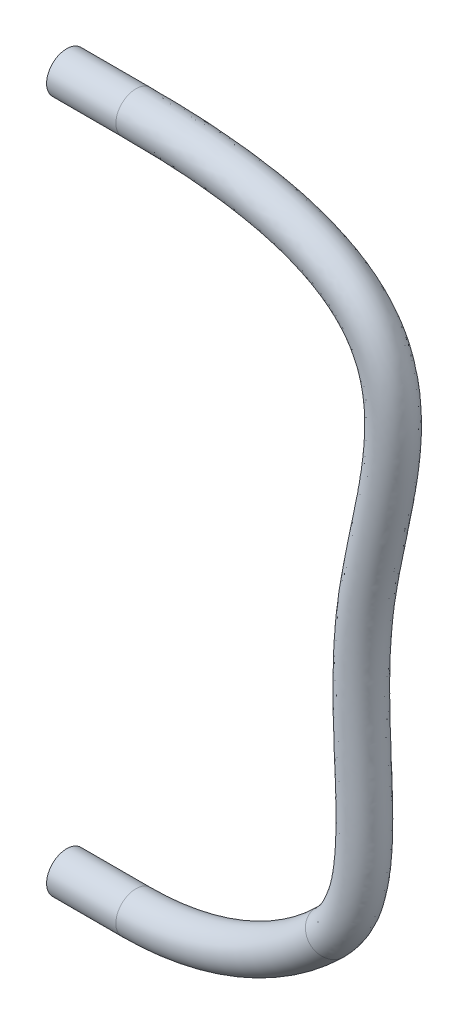
ISO-10303-21;
HEADER;
FILE_DESCRIPTION(('STEP AP214'),'2;1');
FILE_NAME('part.step','',(''),(''),'','','');
FILE_SCHEMA(('AUTOMOTIVE_DESIGN { 1 0 10303 214 1 1 1 1 }'));
ENDSEC;
DATA;
#1=APPLICATION_CONTEXT('core data for automotive mechanical design processes');
#2=APPLICATION_PROTOCOL_DEFINITION('international standard','automotive_design',2000,#1);
#3=PRODUCT_CONTEXT('',#1,'mechanical');
#4=PRODUCT('Part','Part','',(#3));
#5=PRODUCT_RELATED_PRODUCT_CATEGORY('part','',(#4));
#6=PRODUCT_DEFINITION_FORMATION('','',#4);
#7=PRODUCT_DEFINITION_CONTEXT('part definition',#1,'design');
#8=PRODUCT_DEFINITION('design','',#6,#7);
#9=PRODUCT_DEFINITION_SHAPE('','',#8);
#10=(LENGTH_UNIT() NAMED_UNIT(*) SI_UNIT(.MILLI.,.METRE.));
#11=(NAMED_UNIT(*) PLANE_ANGLE_UNIT() SI_UNIT($,.RADIAN.));
#12=(NAMED_UNIT(*) SI_UNIT($,.STERADIAN.) SOLID_ANGLE_UNIT());
#13=UNCERTAINTY_MEASURE_WITH_UNIT(LENGTH_MEASURE(1.E-05),#10,'distance_accuracy_value','');
#14=(GEOMETRIC_REPRESENTATION_CONTEXT(3) GLOBAL_UNCERTAINTY_ASSIGNED_CONTEXT((#13)) GLOBAL_UNIT_ASSIGNED_CONTEXT((#10,
#11,#12)) REPRESENTATION_CONTEXT('',''));
#15=CARTESIAN_POINT('',(0.,0.,0.));
#16=DIRECTION('',(0.,0.,1.));
#17=DIRECTION('',(1.,0.,0.));
#18=AXIS2_PLACEMENT_3D('',#15,#16,#17);
#19=CARTESIAN_POINT('',(49.9999999999996,500.,0.));
#20=DIRECTION('',(-1.,0.,0.));
#21=DIRECTION('',(0.,0.,1.));
#22=AXIS2_PLACEMENT_3D('',#19,#20,#21);
#23=CYLINDRICAL_SURFACE('',#22,14.5);
#24=CARTESIAN_POINT('',(49.9999999999996,500.,0.));
#25=DIRECTION('',(-1.,0.,0.));
#26=DIRECTION('',(0.,0.,-1.));
#27=AXIS2_PLACEMENT_3D('',#24,#25,#26);
#28=CIRCLE('',#27,14.5);
#29=CARTESIAN_POINT('',(49.9999999999996,500.,14.5));
#30=VERTEX_POINT('',#29);
#31=EDGE_CURVE('E68',#30,#30,#28,.T.);
#32=CARTESIAN_POINT('',(-3.95516952522712E-13,500.,0.));
#33=DIRECTION('',(-1.,0.,0.));
#34=DIRECTION('',(0.,0.,-1.));
#35=AXIS2_PLACEMENT_3D('',#32,#33,#34);
#36=CIRCLE('',#35,14.5);
#37=CARTESIAN_POINT('',(-3.95516952522712E-13,500.,14.5));
#38=VERTEX_POINT('',#37);
#39=EDGE_CURVE('E11',#38,#38,#36,.T.);
#40=CARTESIAN_POINT('',(49.9999999999996,500.,14.5));
#41=CARTESIAN_POINT('',(49.4791666666663,500.,14.5));
#42=CARTESIAN_POINT('',(48.9583333333329,500.,14.5));
#43=CARTESIAN_POINT('',(47.9166666666663,500.,14.5));
#44=CARTESIAN_POINT('',(47.3958333333329,500.,14.5));
#45=CARTESIAN_POINT('',(46.3541666666663,500.,14.5));
#46=CARTESIAN_POINT('',(45.8333333333329,500.,14.5));
#47=CARTESIAN_POINT('',(44.7916666666663,500.,14.5));
#48=CARTESIAN_POINT('',(44.2708333333329,500.,14.5));
#49=CARTESIAN_POINT('',(43.2291666666663,500.,14.5));
#50=CARTESIAN_POINT('',(42.7083333333329,500.,14.5));
#51=CARTESIAN_POINT('',(41.6666666666663,500.,14.5));
#52=CARTESIAN_POINT('',(41.1458333333329,500.,14.5));
#53=CARTESIAN_POINT('',(40.1041666666663,500.,14.5));
#54=CARTESIAN_POINT('',(39.5833333333329,500.,14.5));
#55=CARTESIAN_POINT('',(38.5416666666663,500.,14.5));
#56=CARTESIAN_POINT('',(38.0208333333329,500.,14.5));
#57=CARTESIAN_POINT('',(36.9791666666663,500.,14.5));
#58=CARTESIAN_POINT('',(36.4583333333329,500.,14.5));
#59=CARTESIAN_POINT('',(35.4166666666663,500.,14.5));
#60=CARTESIAN_POINT('',(34.8958333333329,500.,14.5));
#61=CARTESIAN_POINT('',(33.8541666666663,500.,14.5));
#62=CARTESIAN_POINT('',(33.3333333333329,500.,14.5));
#63=CARTESIAN_POINT('',(32.2916666666663,500.,14.5));
#64=CARTESIAN_POINT('',(31.7708333333329,500.,14.5));
#65=CARTESIAN_POINT('',(30.7291666666663,500.,14.5));
#66=CARTESIAN_POINT('',(30.2083333333329,500.,14.5));
#67=CARTESIAN_POINT('',(29.1666666666663,500.,14.5));
#68=CARTESIAN_POINT('',(28.6458333333329,500.,14.5));
#69=CARTESIAN_POINT('',(27.6041666666663,500.,14.5));
#70=CARTESIAN_POINT('',(27.0833333333329,500.,14.5));
#71=CARTESIAN_POINT('',(26.0416666666663,500.,14.5));
#72=CARTESIAN_POINT('',(25.5208333333329,500.,14.5));
#73=CARTESIAN_POINT('',(24.4791666666663,500.,14.5));
#74=CARTESIAN_POINT('',(23.9583333333329,500.,14.5));
#75=CARTESIAN_POINT('',(22.9166666666663,500.,14.5));
#76=CARTESIAN_POINT('',(22.3958333333329,500.,14.5));
#77=CARTESIAN_POINT('',(21.3541666666663,500.,14.5));
#78=CARTESIAN_POINT('',(20.8333333333329,500.,14.5));
#79=CARTESIAN_POINT('',(19.7916666666663,500.,14.5));
#80=CARTESIAN_POINT('',(19.2708333333329,500.,14.5));
#81=CARTESIAN_POINT('',(18.2291666666663,500.,14.5));
#82=CARTESIAN_POINT('',(17.7083333333329,500.,14.5));
#83=CARTESIAN_POINT('',(16.6666666666663,500.,14.5));
#84=CARTESIAN_POINT('',(16.1458333333329,500.,14.5));
#85=CARTESIAN_POINT('',(15.1041666666663,500.,14.5));
#86=CARTESIAN_POINT('',(14.5833333333329,500.,14.5));
#87=CARTESIAN_POINT('',(13.5416666666663,500.,14.5));
#88=CARTESIAN_POINT('',(13.0208333333329,500.,14.5));
#89=CARTESIAN_POINT('',(11.9791666666663,500.,14.5));
#90=CARTESIAN_POINT('',(11.4583333333329,500.,14.5));
#91=CARTESIAN_POINT('',(10.4166666666663,500.,14.5));
#92=CARTESIAN_POINT('',(9.89583333333294,500.,14.5));
#93=CARTESIAN_POINT('',(8.85416666666627,500.,14.5));
#94=CARTESIAN_POINT('',(8.33333333333294,500.,14.5));
#95=CARTESIAN_POINT('',(7.29166666666627,500.,14.5));
#96=CARTESIAN_POINT('',(6.77083333333294,500.,14.5));
#97=CARTESIAN_POINT('',(5.72916666666627,500.,14.5));
#98=CARTESIAN_POINT('',(5.20833333333294,500.,14.5));
#99=CARTESIAN_POINT('',(4.16666666666627,500.,14.5));
#100=CARTESIAN_POINT('',(3.64583333333294,500.,14.5));
#101=CARTESIAN_POINT('',(2.60416666666627,500.,14.5));
#102=CARTESIAN_POINT('',(2.08333333333294,500.,14.5));
#103=CARTESIAN_POINT('',(1.04166666666627,500.,14.5));
#104=CARTESIAN_POINT('',(0.520833333332938,500.,14.5));
#105=CARTESIAN_POINT('',(-3.95516952522712E-13,500.,14.5));
#106=B_SPLINE_CURVE_WITH_KNOTS('',3,(#40,#41,#42,#43,#44,#45,#46,#47,#48,#49,#50,#51,#52,#53,
#54,#55,#56,#57,#58,#59,#60,#61,#62,#63,#64,#65,#66,#67,#68,#69,#70,#71,#72,#73,#74,#75,#76,#77,
#78,#79,#80,#81,#82,#83,#84,#85,#86,#87,#88,#89,#90,#91,#92,#93,#94,#95,#96,#97,#98,#99,#100,
#101,#102,#103,#104,#105),.UNSPECIFIED.,.F.,.F.,(4,2,2,2,2,2,2,2,2,2,2,2,2,2,2,2,2,2,2,2,2,2,2,
2,2,2,2,2,2,2,2,2,4),(0.,1.56249999999999,3.125,4.6875,6.25,7.81249999999999,9.37499999999999,
10.9375,12.5,14.0625,15.625,17.1875,18.75,20.3125,21.875,23.4375,25.,26.5625,28.125,29.6875,
31.25,32.8125,34.375,35.9375,37.5,39.0625,40.625,42.1875,43.75,45.3125,46.875,48.4375,50.),.UNSPECIFIED.);
#107=EDGE_CURVE('BSEAM50',#30,#38,#106,.T.);
#108=ORIENTED_EDGE('',*,*,#31,.T.);
#109=ORIENTED_EDGE('',*,*,#39,.F.);
#110=ORIENTED_EDGE('',*,*,#107,.T.);
#111=ORIENTED_EDGE('',*,*,#107,.F.);
#112=EDGE_LOOP('',(#108,#110,#109,#111));
#113=FACE_BOUND('',#112,.T.);
#114=ADVANCED_FACE('F50',(#113),#23,.T.);
#115=CARTESIAN_POINT('',(50.,200.,0.));
#116=DIRECTION('',(0.,0.,1.));
#117=DIRECTION('',(1.,0.,0.));
#118=AXIS2_PLACEMENT_3D('',#115,#116,#117);
#119=TOROIDAL_SURFACE('',#118,200.,14.5);
#120=CARTESIAN_POINT('',(50.,0.,0.));
#121=DIRECTION('',(1.,0.,0.));
#122=DIRECTION('',(0.,0.,-1.));
#123=AXIS2_PLACEMENT_3D('',#120,#121,#122);
#124=CIRCLE('',#123,14.5);
#125=CARTESIAN_POINT('',(50.,-14.5,0.));
#126=VERTEX_POINT('',#125);
#127=EDGE_CURVE('E60',#126,#126,#124,.T.);
#128=CARTESIAN_POINT('',(190.,57.171431429143,0.));
#129=DIRECTION('',(0.714142842854285,0.7,0.));
#130=DIRECTION('',(0.,0.,-1.));
#131=AXIS2_PLACEMENT_3D('',#128,#129,#130);
#132=CIRCLE('',#131,14.5);
#133=CARTESIAN_POINT('',(200.15,46.8163602077558,0.));
#134=VERTEX_POINT('',#133);
#135=EDGE_CURVE('E56',#134,#134,#132,.T.);
#136=CARTESIAN_POINT('',(50.,200.,0.));
#137=DIRECTION('',(0.,0.,1.));
#138=DIRECTION('',(1.,0.,0.));
#139=AXIS2_PLACEMENT_3D('',#136,#137,#138);
#140=CIRCLE('',#139,214.5);
#141=EDGE_CURVE('',#126,#134,#140,.T.);
#142=ORIENTED_EDGE('',*,*,#127,.T.);
#143=ORIENTED_EDGE('',*,*,#135,.F.);
#144=ORIENTED_EDGE('',*,*,#141,.T.);
#145=ORIENTED_EDGE('',*,*,#141,.F.);
#146=EDGE_LOOP('',(#142,#144,#143,#145));
#147=FACE_BOUND('',#146,.T.);
#148=ADVANCED_FACE('F87',(#147),#119,.T.);
#149=CARTESIAN_POINT('',(50.,0.,0.));
#150=DIRECTION('',(-1.,0.,0.));
#151=DIRECTION('',(0.,0.,1.));
#152=AXIS2_PLACEMENT_3D('',#149,#150,#151);
#153=CYLINDRICAL_SURFACE('',#152,14.5);
#154=ORIENTED_EDGE('',*,*,#127,.F.);
#155=EDGE_LOOP('',(#154));
#156=FACE_BOUND('',#155,.T.);
#157=CARTESIAN_POINT('',(0.,0.,0.));
#158=DIRECTION('',(1.,0.,0.));
#159=DIRECTION('',(0.,0.,-1.));
#160=AXIS2_PLACEMENT_3D('',#157,#158,#159);
#161=CIRCLE('',#160,14.5);
#162=CARTESIAN_POINT('',(0.,0.,-14.5));
#163=VERTEX_POINT('',#162);
#164=EDGE_CURVE('E64',#163,#163,#161,.T.);
#165=ORIENTED_EDGE('',*,*,#164,.T.);
#166=EDGE_LOOP('',(#165));
#167=FACE_BOUND('',#166,.T.);
#168=ADVANCED_FACE('F91',(#156,#167),#153,.T.);
#169=CARTESIAN_POINT('',(0.,0.,0.));
#170=DIRECTION('',(1.,0.,0.));
#171=DIRECTION('',(0.,0.,-1.));
#172=AXIS2_PLACEMENT_3D('',#169,#170,#171);
#173=PLANE('',#172);
#174=ORIENTED_EDGE('',*,*,#164,.F.);
#175=EDGE_LOOP('',(#174));
#176=FACE_BOUND('',#175,.T.);
#177=ADVANCED_FACE('F82',(#176),#173,.F.);
#178=CARTESIAN_POINT('',(-3.95516952522712E-13,500.,0.));
#179=DIRECTION('',(-1.,0.,0.));
#180=DIRECTION('',(0.,0.,-1.));
#181=AXIS2_PLACEMENT_3D('',#178,#179,#180);
#182=PLANE('',#181);
#183=ORIENTED_EDGE('',*,*,#39,.T.);
#184=EDGE_LOOP('',(#183));
#185=FACE_BOUND('',#184,.T.);
#186=ADVANCED_FACE('F77',(#185),#182,.T.);
#187=CARTESIAN_POINT('',(190.,57.171431429143,-14.5));
#188=CARTESIAN_POINT('',(194.944842449833,62.0183465099527,-14.5));
#189=CARTESIAN_POINT('',(202.951550368549,72.6929623445116,-14.5));
#190=CARTESIAN_POINT('',(210.31382625523,91.4075178971451,-14.5));
#191=CARTESIAN_POINT('',(214.029461101954,112.584980032532,-14.5));
#192=CARTESIAN_POINT('',(215.863984687444,152.700368889867,-14.5));
#193=CARTESIAN_POINT('',(211.280771673984,206.672860303372,-14.5));
#194=CARTESIAN_POINT('',(213.566897052587,258.982853629339,-14.5));
#195=CARTESIAN_POINT('',(219.6745617368,300.751303923281,-14.5));
#196=CARTESIAN_POINT('',(228.070292093363,336.023093604827,-14.5));
#197=CARTESIAN_POINT('',(235.140291346087,377.834515537395,-14.5));
#198=CARTESIAN_POINT('',(236.335787132934,408.040783120431,-14.5));
#199=CARTESIAN_POINT('',(231.831090363544,430.49628507942,-14.5));
#200=CARTESIAN_POINT('',(224.082473035944,446.277167583779,-14.5));
#201=CARTESIAN_POINT('',(216.420618309054,456.714655245031,-14.5));
#202=CARTESIAN_POINT('',(206.399580794928,466.235012824428,-14.5));
#203=CARTESIAN_POINT('',(193.787305770649,474.755681510549,-14.5));
#204=CARTESIAN_POINT('',(174.921612456109,483.847084932289,-14.5));
#205=CARTESIAN_POINT('',(146.74142116915,492.348139726263,-14.5));
#206=CARTESIAN_POINT('',(104.664413539392,498.539258728495,-14.5));
#207=CARTESIAN_POINT('',(69.5225886398515,500.,-14.5));
#208=CARTESIAN_POINT('',(49.9999999999996,500.,-14.5));
#209=CARTESIAN_POINT('',(169.7,77.8815738719173,-14.5));
#210=CARTESIAN_POINT('',(174.644842449833,82.728488952727,-14.5));
#211=CARTESIAN_POINT('',(176.230611912776,85.843605342476,-14.5));
#212=CARTESIAN_POINT('',(182.332309903121,99.0837889498667,-14.5));
#213=CARTESIAN_POINT('',(185.0208752628,115.286778973782,-14.5));
#214=CARTESIAN_POINT('',(186.887253376729,150.924680172337,-14.5));
#215=CARTESIAN_POINT('',(182.133285549426,204.768076251786,-14.5));
#216=CARTESIAN_POINT('',(184.748735663511,261.950203556697,-14.5));
#217=CARTESIAN_POINT('',(191.15479980805,306.446688638503,-14.5));
#218=CARTESIAN_POINT('',(199.82131627766,342.618763312055,-14.5));
#219=CARTESIAN_POINT('',(206.287671065404,381.34541559297,-14.5));
#220=CARTESIAN_POINT('',(207.110284171086,406.509956650255,-14.5));
#221=CARTESIAN_POINT('',(203.803730261991,421.741423388913,-14.5));
#222=CARTESIAN_POINT('',(199.147742739472,431.164642376791,-14.5));
#223=CARTESIAN_POINT('',(194.618243954749,437.354918237821,-14.5));
#224=CARTESIAN_POINT('',(188.308717536378,443.396620476437,-14.5));
#225=CARTESIAN_POINT('',(179.496918086823,449.405585731971,-14.5));
#226=CARTESIAN_POINT('',(164.899448228437,456.488020905377,-14.5));
#227=CARTESIAN_POINT('',(140.969785721538,463.848970750561,-14.5));
#228=CARTESIAN_POINT('',(101.934320374639,469.589409808704,-14.5));
#229=CARTESIAN_POINT('',(69.5225886398517,471.,-14.5));
#230=CARTESIAN_POINT('',(49.9999999999998,471.,-14.5));
#231=CARTESIAN_POINT('',(169.7,77.8815738719173,14.5));
#232=CARTESIAN_POINT('',(174.644842449833,82.728488952727,14.5));
#233=CARTESIAN_POINT('',(176.230611912776,85.843605342476,14.5));
#234=CARTESIAN_POINT('',(182.332309903121,99.0837889498667,14.5));
#235=CARTESIAN_POINT('',(185.0208752628,115.286778973782,14.5));
#236=CARTESIAN_POINT('',(186.887253376729,150.924680172337,14.5));
#237=CARTESIAN_POINT('',(182.133285549426,204.768076251786,14.5));
#238=CARTESIAN_POINT('',(184.748735663511,261.950203556697,14.5));
#239=CARTESIAN_POINT('',(191.15479980805,306.446688638503,14.5));
#240=CARTESIAN_POINT('',(199.82131627766,342.618763312055,14.5));
#241=CARTESIAN_POINT('',(206.287671065404,381.34541559297,14.5));
#242=CARTESIAN_POINT('',(207.110284171086,406.509956650255,14.5));
#243=CARTESIAN_POINT('',(203.803730261991,421.741423388913,14.5));
#244=CARTESIAN_POINT('',(199.147742739472,431.164642376791,14.5));
#245=CARTESIAN_POINT('',(194.618243954749,437.354918237821,14.5));
#246=CARTESIAN_POINT('',(188.308717536378,443.396620476437,14.5));
#247=CARTESIAN_POINT('',(179.496918086823,449.405585731971,14.5));
#248=CARTESIAN_POINT('',(164.899448228437,456.488020905377,14.5));
#249=CARTESIAN_POINT('',(140.969785721538,463.848970750561,14.5));
#250=CARTESIAN_POINT('',(101.934320374639,469.589409808704,14.5));
#251=CARTESIAN_POINT('',(69.5225886398517,471.,14.5));
#252=CARTESIAN_POINT('',(49.9999999999998,471.,14.5));
#253=CARTESIAN_POINT('',(190.,57.171431429143,14.5));
#254=CARTESIAN_POINT('',(194.944842449833,62.0183465099527,14.5));
#255=CARTESIAN_POINT('',(202.951550368549,72.6929623445116,14.5));
#256=CARTESIAN_POINT('',(210.31382625523,91.4075178971451,14.5));
#257=CARTESIAN_POINT('',(214.029461101954,112.584980032532,14.5));
#258=CARTESIAN_POINT('',(215.863984687444,152.700368889867,14.5));
#259=CARTESIAN_POINT('',(211.280771673984,206.672860303372,14.5));
#260=CARTESIAN_POINT('',(213.566897052587,258.982853629339,14.5));
#261=CARTESIAN_POINT('',(219.6745617368,300.751303923281,14.5));
#262=CARTESIAN_POINT('',(228.070292093363,336.023093604827,14.5));
#263=CARTESIAN_POINT('',(235.140291346087,377.834515537395,14.5));
#264=CARTESIAN_POINT('',(236.335787132934,408.040783120431,14.5));
#265=CARTESIAN_POINT('',(231.831090363544,430.49628507942,14.5));
#266=CARTESIAN_POINT('',(224.082473035944,446.277167583779,14.5));
#267=CARTESIAN_POINT('',(216.420618309054,456.714655245031,14.5));
#268=CARTESIAN_POINT('',(206.399580794928,466.235012824428,14.5));
#269=CARTESIAN_POINT('',(193.787305770649,474.755681510549,14.5));
#270=CARTESIAN_POINT('',(174.921612456109,483.847084932289,14.5));
#271=CARTESIAN_POINT('',(146.74142116915,492.348139726263,14.5));
#272=CARTESIAN_POINT('',(104.664413539392,498.539258728495,14.5));
#273=CARTESIAN_POINT('',(69.5225886398515,500.,14.5));
#274=CARTESIAN_POINT('',(49.9999999999996,500.,14.5));
#275=CARTESIAN_POINT('',(210.3,36.4612889863687,14.5));
#276=CARTESIAN_POINT('',(215.244842449833,41.3082040671785,14.5));
#277=CARTESIAN_POINT('',(229.672488824321,59.5423193465473,14.5));
#278=CARTESIAN_POINT('',(238.295342607339,83.7312468444234,14.5));
#279=CARTESIAN_POINT('',(243.038046941108,109.883181091283,14.5));
#280=CARTESIAN_POINT('',(244.840715998159,154.476057607397,14.5));
#281=CARTESIAN_POINT('',(240.428257798541,208.577644354958,14.5));
#282=CARTESIAN_POINT('',(242.385058441662,256.015503701982,14.5));
#283=CARTESIAN_POINT('',(248.194323665551,295.055919208058,14.5));
#284=CARTESIAN_POINT('',(256.319267909066,329.4274238976,14.5));
#285=CARTESIAN_POINT('',(263.99291162677,374.323615481819,14.5));
#286=CARTESIAN_POINT('',(265.561290094783,409.571609590608,14.5));
#287=CARTESIAN_POINT('',(259.858450465097,439.251146769926,14.5));
#288=CARTESIAN_POINT('',(249.017203332416,461.389692790767,14.5));
#289=CARTESIAN_POINT('',(238.222992663359,476.074392252241,14.5));
#290=CARTESIAN_POINT('',(224.490444053477,489.073405172419,14.5));
#291=CARTESIAN_POINT('',(208.077693454475,500.105777289127,14.5));
#292=CARTESIAN_POINT('',(184.943776683782,511.206148959202,14.5));
#293=CARTESIAN_POINT('',(152.513056616762,520.847308701964,14.5));
#294=CARTESIAN_POINT('',(107.394506704145,527.489107648285,14.5));
#295=CARTESIAN_POINT('',(69.5225886398513,529.,14.5));
#296=CARTESIAN_POINT('',(49.9999999999994,529.,14.5));
#297=CARTESIAN_POINT('',(210.3,36.4612889863687,-14.5));
#298=CARTESIAN_POINT('',(215.244842449833,41.3082040671785,-14.5));
#299=CARTESIAN_POINT('',(229.672488824321,59.5423193465473,-14.5));
#300=CARTESIAN_POINT('',(238.295342607339,83.7312468444234,-14.5));
#301=CARTESIAN_POINT('',(243.038046941108,109.883181091283,-14.5));
#302=CARTESIAN_POINT('',(244.840715998159,154.476057607397,-14.5));
#303=CARTESIAN_POINT('',(240.428257798541,208.577644354958,-14.5));
#304=CARTESIAN_POINT('',(242.385058441662,256.015503701982,-14.5));
#305=CARTESIAN_POINT('',(248.194323665551,295.055919208058,-14.5));
#306=CARTESIAN_POINT('',(256.319267909066,329.4274238976,-14.5));
#307=CARTESIAN_POINT('',(263.99291162677,374.323615481819,-14.5));
#308=CARTESIAN_POINT('',(265.561290094783,409.571609590608,-14.5));
#309=CARTESIAN_POINT('',(259.858450465097,439.251146769926,-14.5));
#310=CARTESIAN_POINT('',(249.017203332416,461.389692790767,-14.5));
#311=CARTESIAN_POINT('',(238.222992663359,476.074392252241,-14.5));
#312=CARTESIAN_POINT('',(224.490444053477,489.073405172419,-14.5));
#313=CARTESIAN_POINT('',(208.077693454475,500.105777289127,-14.5));
#314=CARTESIAN_POINT('',(184.943776683782,511.206148959202,-14.5));
#315=CARTESIAN_POINT('',(152.513056616762,520.847308701964,-14.5));
#316=CARTESIAN_POINT('',(107.394506704145,527.489107648285,-14.5));
#317=CARTESIAN_POINT('',(69.5225886398513,529.,-14.5));
#318=CARTESIAN_POINT('',(49.9999999999994,529.,-14.5));
#319=CARTESIAN_POINT('',(190.,57.171431429143,-14.5));
#320=CARTESIAN_POINT('',(194.944842449833,62.0183465099527,-14.5));
#321=CARTESIAN_POINT('',(202.951550368549,72.6929623445116,-14.5));
#322=CARTESIAN_POINT('',(210.31382625523,91.4075178971451,-14.5));
#323=CARTESIAN_POINT('',(214.029461101954,112.584980032532,-14.5));
#324=CARTESIAN_POINT('',(215.863984687444,152.700368889867,-14.5));
#325=CARTESIAN_POINT('',(211.280771673984,206.672860303372,-14.5));
#326=CARTESIAN_POINT('',(213.566897052587,258.982853629339,-14.5));
#327=CARTESIAN_POINT('',(219.6745617368,300.751303923281,-14.5));
#328=CARTESIAN_POINT('',(228.070292093363,336.023093604827,-14.5));
#329=CARTESIAN_POINT('',(235.140291346087,377.834515537395,-14.5));
#330=CARTESIAN_POINT('',(236.335787132934,408.040783120431,-14.5));
#331=CARTESIAN_POINT('',(231.831090363544,430.49628507942,-14.5));
#332=CARTESIAN_POINT('',(224.082473035944,446.277167583779,-14.5));
#333=CARTESIAN_POINT('',(216.420618309054,456.714655245031,-14.5));
#334=CARTESIAN_POINT('',(206.399580794928,466.235012824428,-14.5));
#335=CARTESIAN_POINT('',(193.787305770649,474.755681510549,-14.5));
#336=CARTESIAN_POINT('',(174.921612456109,483.847084932289,-14.5));
#337=CARTESIAN_POINT('',(146.74142116915,492.348139726263,-14.5));
#338=CARTESIAN_POINT('',(104.664413539392,498.539258728495,-14.5));
#339=CARTESIAN_POINT('',(69.5225886398515,500.,-14.5));
#340=CARTESIAN_POINT('',(49.9999999999996,500.,-14.5));
#341=(BOUNDED_SURFACE() B_SPLINE_SURFACE(3,3,((#187,#188,#189,#190,#191,#192,#193,#194,#195,
#196,#197,#198,#199,#200,#201,#202,#203,#204,#205,#206,#207,#208),(#209,#210,#211,#212,#213,
#214,#215,#216,#217,#218,#219,#220,#221,#222,#223,#224,#225,#226,#227,#228,#229,#230),(#231,
#232,#233,#234,#235,#236,#237,#238,#239,#240,#241,#242,#243,#244,#245,#246,#247,#248,#249,#250,
#251,#252),(#253,#254,#255,#256,#257,#258,#259,#260,#261,#262,#263,#264,#265,#266,#267,#268,
#269,#270,#271,#272,#273,#274),(#275,#276,#277,#278,#279,#280,#281,#282,#283,#284,#285,#286,
#287,#288,#289,#290,#291,#292,#293,#294,#295,#296),(#297,#298,#299,#300,#301,#302,#303,#304,
#305,#306,#307,#308,#309,#310,#311,#312,#313,#314,#315,#316,#317,#318),(#319,#320,#321,#322,
#323,#324,#325,#326,#327,#328,#329,#330,#331,#332,#333,#334,#335,#336,#337,#338,#339,#340)),
.UNSPECIFIED.,.T.,.F.,.F.) B_SPLINE_SURFACE_WITH_KNOTS((4,3,4),(4,1,1,1,1,1,1,1,1,1,1,1,1,1,1,1,
1,1,1,4),(0.,0.5,1.),(0.,0.052500000000028,0.105,0.1575,0.21,0.375,0.466511448766878,0.48,
0.584999999999983,0.64,0.695,0.75,0.775,0.8,0.825,0.85,0.875,0.916666666666679,
0.958333333333333,1.),
.UNSPECIFIED.) GEOMETRIC_REPRESENTATION_ITEM() RATIONAL_B_SPLINE_SURFACE(((1.,1.,1.,1.,1.,1.,1.,
1.,1.,1.,1.,1.,1.,1.,1.,1.,1.,1.,1.,1.,1.,1.),(0.333333333333333,0.333333333333333,
0.333333333333334,0.333333333333333,0.333333333333333,0.333333333333333,0.333333333333333,
0.333333333333333,0.333333333333333,0.333333333333333,0.333333333333333,0.333333333333333,
0.333333333333333,0.333333333333333,0.333333333333333,0.333333333333333,0.333333333333333,
0.333333333333333,0.333333333333333,0.333333333333333,0.333333333333333,0.333333333333333),
(0.333333333333333,0.333333333333333,0.333333333333334,0.333333333333333,0.333333333333333,
0.333333333333333,0.333333333333333,0.333333333333333,0.333333333333333,0.333333333333333,
0.333333333333333,0.333333333333333,0.333333333333333,0.333333333333333,0.333333333333333,
0.333333333333333,0.333333333333333,0.333333333333333,0.333333333333333,0.333333333333333,
0.333333333333333,0.333333333333333),(1.,1.,1.,1.,1.,1.,1.,1.,1.,1.,1.,1.,1.,1.,1.,1.,1.,1.,1.,
1.,1.,1.),(0.333333333333333,0.333333333333333,0.333333333333334,0.333333333333333,
0.333333333333333,0.333333333333333,0.333333333333333,0.333333333333333,0.333333333333333,
0.333333333333333,0.333333333333333,0.333333333333333,0.333333333333333,0.333333333333333,
0.333333333333333,0.333333333333333,0.333333333333333,0.333333333333333,0.333333333333333,
0.333333333333333,0.333333333333333,0.333333333333333),(0.333333333333333,0.333333333333333,
0.333333333333334,0.333333333333333,0.333333333333333,0.333333333333333,0.333333333333333,
0.333333333333333,0.333333333333333,0.333333333333333,0.333333333333333,0.333333333333333,
0.333333333333333,0.333333333333333,0.333333333333333,0.333333333333333,0.333333333333333,
0.333333333333333,0.333333333333333,0.333333333333333,0.333333333333333,0.333333333333333),(1.,
1.,1.,1.,1.,1.,1.,1.,1.,1.,1.,1.,1.,1.,1.,1.,1.,1.,1.,1.,1.,1.))) REPRESENTATION_ITEM('') SURFACE());
#342=ORIENTED_EDGE('',*,*,#135,.T.);
#343=EDGE_LOOP('',(#342));
#344=FACE_BOUND('',#343,.T.);
#345=ORIENTED_EDGE('',*,*,#31,.F.);
#346=EDGE_LOOP('',(#345));
#347=FACE_BOUND('',#346,.T.);
#348=ADVANCED_FACE('F75',(#344,#347),#341,.T.);
#349=CLOSED_SHELL('',(#114,#148,#168,#177,#186,#348));
#350=MANIFOLD_SOLID_BREP('B2',#349);
#351=ADVANCED_BREP_SHAPE_REPRESENTATION('',(#18,#350),#14);
#352=SHAPE_DEFINITION_REPRESENTATION(#9,#351);
ENDSEC;
END-ISO-10303-21;
